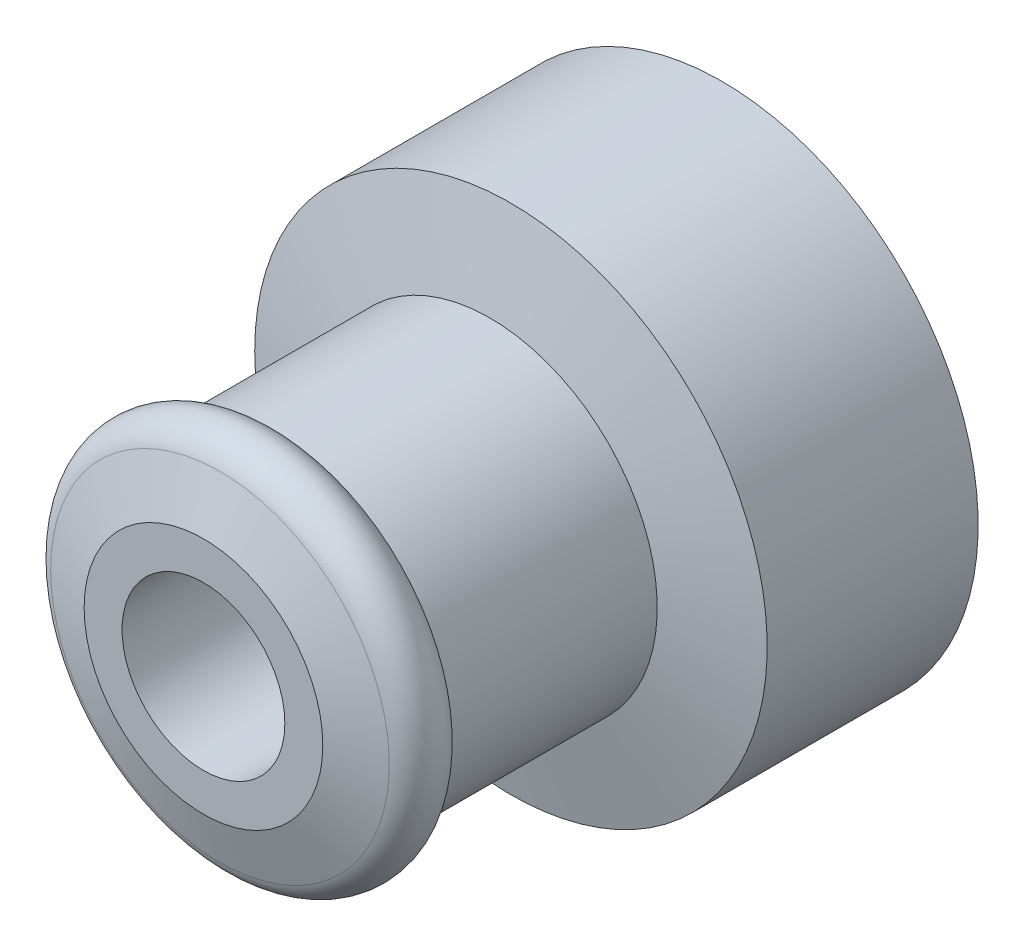
ISO-10303-21;
HEADER;
FILE_DESCRIPTION(('STEP AP214'),'2;1');
FILE_NAME('part.step','',(''),(''),'','','');
FILE_SCHEMA(('AUTOMOTIVE_DESIGN { 1 0 10303 214 1 1 1 1 }'));
ENDSEC;
DATA;
#1=APPLICATION_CONTEXT('core data for automotive mechanical design processes');
#2=APPLICATION_PROTOCOL_DEFINITION('international standard','automotive_design',2000,#1);
#3=PRODUCT_CONTEXT('',#1,'mechanical');
#4=PRODUCT('Part','Part','',(#3));
#5=PRODUCT_RELATED_PRODUCT_CATEGORY('part','',(#4));
#6=PRODUCT_DEFINITION_FORMATION('','',#4);
#7=PRODUCT_DEFINITION_CONTEXT('part definition',#1,'design');
#8=PRODUCT_DEFINITION('design','',#6,#7);
#9=PRODUCT_DEFINITION_SHAPE('','',#8);
#10=(LENGTH_UNIT() NAMED_UNIT(*) SI_UNIT(.MILLI.,.METRE.));
#11=(NAMED_UNIT(*) PLANE_ANGLE_UNIT() SI_UNIT($,.RADIAN.));
#12=(NAMED_UNIT(*) SI_UNIT($,.STERADIAN.) SOLID_ANGLE_UNIT());
#13=UNCERTAINTY_MEASURE_WITH_UNIT(LENGTH_MEASURE(1.E-05),#10,'distance_accuracy_value','');
#14=(GEOMETRIC_REPRESENTATION_CONTEXT(3) GLOBAL_UNCERTAINTY_ASSIGNED_CONTEXT((#13)) GLOBAL_UNIT_ASSIGNED_CONTEXT((#10,
#11,#12)) REPRESENTATION_CONTEXT('',''));
#15=CARTESIAN_POINT('',(0.,0.,0.));
#16=DIRECTION('',(0.,0.,1.));
#17=DIRECTION('',(1.,0.,0.));
#18=AXIS2_PLACEMENT_3D('',#15,#16,#17);
#19=CARTESIAN_POINT('',(7.99999999999999,0.,-8.00000000000004));
#20=DIRECTION('',(0.,0.,-1.));
#21=DIRECTION('',(-1.,0.,0.));
#22=AXIS2_PLACEMENT_3D('',#19,#20,#21);
#23=PLANE('',#22);
#24=CARTESIAN_POINT('',(7.99999999999999,0.,-8.00000000000004));
#25=DIRECTION('',(0.,0.,-1.));
#26=DIRECTION('',(-1.,0.,0.));
#27=AXIS2_PLACEMENT_3D('',#24,#25,#26);
#28=CIRCLE('',#27,8.5);
#29=CARTESIAN_POINT('',(-0.500000000000007,0.,-8.00000000000005));
#30=VERTEX_POINT('',#29);
#31=EDGE_CURVE('E161',#30,#30,#28,.T.);
#32=ORIENTED_EDGE('',*,*,#31,.T.);
#33=EDGE_LOOP('',(#32));
#34=FACE_BOUND('',#33,.T.);
#35=DIRECTION('',(0.,1.,0.));
#36=VECTOR('',#35,1.);
#37=CARTESIAN_POINT('',(5.49999999999999,0.,-8.00000000000004));
#38=LINE('',#37,#36);
#39=CARTESIAN_POINT('',(5.49999999999999,-2.80615724127025,-8.00000000000004));
#40=VERTEX_POINT('',#39);
#41=CARTESIAN_POINT('',(5.49999999999999,-1.61245154965971,-8.00000000000004));
#42=VERTEX_POINT('',#41);
#43=EDGE_CURVE('E153',#40,#42,#38,.T.);
#44=ORIENTED_EDGE('',*,*,#43,.T.);
#45=CARTESIAN_POINT('',(5.64999999999999,-1.61245154965971,-8.00000000000004));
#46=DIRECTION('',(0.,0.,-1.));
#47=DIRECTION('',(-1.,0.,0.));
#48=AXIS2_PLACEMENT_3D('',#45,#46,#47);
#49=CIRCLE('',#48,0.15);
#50=CARTESIAN_POINT('',(5.77368421052631,-1.52758567862498,-8.00000000000004));
#51=VERTEX_POINT('',#50);
#52=EDGE_CURVE('E214',#42,#51,#49,.T.);
#53=ORIENTED_EDGE('',*,*,#52,.T.);
#54=CARTESIAN_POINT('',(7.99999999999999,0.,-8.00000000000004));
#55=DIRECTION('',(0.,0.,1.));
#56=DIRECTION('',(1.,0.,0.));
#57=AXIS2_PLACEMENT_3D('',#54,#55,#56);
#58=CIRCLE('',#57,2.7);
#59=CARTESIAN_POINT('',(5.77368421052631,1.52758567862499,-8.00000000000004));
#60=VERTEX_POINT('',#59);
#61=EDGE_CURVE('E154',#51,#60,#58,.T.);
#62=ORIENTED_EDGE('',*,*,#61,.T.);
#63=CARTESIAN_POINT('',(5.64999999999999,1.61245154965971,-8.00000000000004));
#64=DIRECTION('',(0.,0.,-1.));
#65=DIRECTION('',(-1.,0.,0.));
#66=AXIS2_PLACEMENT_3D('',#63,#64,#65);
#67=CIRCLE('',#66,0.15);
#68=CARTESIAN_POINT('',(5.49999999999999,1.61245154965971,-8.00000000000004));
#69=VERTEX_POINT('',#68);
#70=EDGE_CURVE('E223',#60,#69,#67,.T.);
#71=ORIENTED_EDGE('',*,*,#70,.T.);
#72=CARTESIAN_POINT('',(5.49999999999999,2.80615724127025,-8.00000000000004));
#73=VERTEX_POINT('',#72);
#74=EDGE_CURVE('E151',#69,#73,#38,.T.);
#75=ORIENTED_EDGE('',*,*,#74,.T.);
#76=DIRECTION('',(-1.,0.,0.));
#77=VECTOR('',#76,1.);
#78=CARTESIAN_POINT('',(7.99999999999999,2.80615724127025,-8.00000000000004));
#79=LINE('',#78,#77);
#80=CARTESIAN_POINT('',(2.69999999999999,2.80615724127025,-8.00000000000004));
#81=VERTEX_POINT('',#80);
#82=EDGE_CURVE('E226',#73,#81,#79,.T.);
#83=ORIENTED_EDGE('',*,*,#82,.T.);
#84=DIRECTION('',(0.,1.,0.));
#85=VECTOR('',#84,1.);
#86=CARTESIAN_POINT('',(2.69999999999999,0.,-8.00000000000004));
#87=LINE('',#86,#85);
#88=CARTESIAN_POINT('',(2.69999999999999,-2.80615724127025,-8.00000000000004));
#89=VERTEX_POINT('',#88);
#90=EDGE_CURVE('E149',#89,#81,#87,.T.);
#91=ORIENTED_EDGE('',*,*,#90,.F.);
#92=DIRECTION('',(1.,0.,0.));
#93=VECTOR('',#92,1.);
#94=CARTESIAN_POINT('',(7.99999999999999,-2.80615724127025,-8.00000000000004));
#95=LINE('',#94,#93);
#96=EDGE_CURVE('E113',#89,#40,#95,.T.);
#97=ORIENTED_EDGE('',*,*,#96,.T.);
#98=EDGE_LOOP('',(#44,#53,#62,#71,#75,#83,#91,#97));
#99=FACE_BOUND('',#98,.T.);
#100=ADVANCED_FACE('F34',(#34,#99),#23,.T.);
#101=CARTESIAN_POINT('',(7.99999999999999,0.,-8.00000000000004));
#102=DIRECTION('',(0.,0.,1.));
#103=DIRECTION('',(1.,0.,0.));
#104=AXIS2_PLACEMENT_3D('',#101,#102,#103);
#105=CYLINDRICAL_SURFACE('',#104,2.7);
#106=CARTESIAN_POINT('',(7.99999999999997,0.,9.19999999999997));
#107=DIRECTION('',(0.,0.,1.));
#108=DIRECTION('',(1.,0.,0.));
#109=AXIS2_PLACEMENT_3D('',#106,#107,#108);
#110=CIRCLE('',#109,2.7);
#111=CARTESIAN_POINT('',(10.7,0.,9.19999999999997));
#112=VERTEX_POINT('',#111);
#113=EDGE_CURVE('E157',#112,#112,#110,.T.);
#114=ORIENTED_EDGE('',*,*,#113,.T.);
#115=EDGE_LOOP('',(#114));
#116=FACE_BOUND('',#115,.T.);
#117=ORIENTED_EDGE('',*,*,#61,.F.);
#118=DIRECTION('',(0.,0.,1.));
#119=VECTOR('',#118,1.);
#120=CARTESIAN_POINT('',(5.77368421052631,-1.52758567862499,-8.00000000000004));
#121=LINE('',#120,#119);
#122=CARTESIAN_POINT('',(5.7736842105263,-1.52758567862499,-2.14168072549279));
#123=VERTEX_POINT('',#122);
#124=EDGE_CURVE('E233',#51,#123,#121,.T.);
#125=ORIENTED_EDGE('',*,*,#124,.T.);
#126=CARTESIAN_POINT('',(7.99999999999998,0.,-1.25972872272844));
#127=DIRECTION('',(0.,0.5,-0.866025403784439));
#128=DIRECTION('',(0.,0.866025403784439,0.5));
#129=AXIS2_PLACEMENT_3D('',#126,#127,#128);
#130=ELLIPSE('',#129,3.11769145362398,2.7);
#131=CARTESIAN_POINT('',(5.29999999999998,0.,-1.25972872272844));
#132=VERTEX_POINT('',#131);
#133=EDGE_CURVE('E55',#132,#123,#130,.F.);
#134=ORIENTED_EDGE('',*,*,#133,.F.);
#135=CARTESIAN_POINT('',(7.99999999999998,0.,-1.25972872272844));
#136=DIRECTION('',(0.,-0.5,-0.866025403784439));
#137=DIRECTION('',(0.,-0.866025403784439,0.5));
#138=AXIS2_PLACEMENT_3D('',#135,#136,#137);
#139=ELLIPSE('',#138,3.11769145362398,2.7);
#140=CARTESIAN_POINT('',(5.7736842105263,1.52758567862499,-2.14168072549279));
#141=VERTEX_POINT('',#140);
#142=EDGE_CURVE('E186',#141,#132,#139,.F.);
#143=ORIENTED_EDGE('',*,*,#142,.F.);
#144=DIRECTION('',(0.,0.,1.));
#145=VECTOR('',#144,1.);
#146=CARTESIAN_POINT('',(5.77368421052631,1.52758567862499,-8.00000000000004));
#147=LINE('',#146,#145);
#148=EDGE_CURVE('E231',#141,#60,#147,.F.);
#149=ORIENTED_EDGE('',*,*,#148,.T.);
#150=EDGE_LOOP('',(#117,#125,#134,#143,#149));
#151=FACE_BOUND('',#150,.T.);
#152=ADVANCED_FACE('F200',(#116,#151),#105,.F.);
#153=CARTESIAN_POINT('',(7.99999999999999,0.,-8.00000000000004));
#154=DIRECTION('',(0.,0.,-1.));
#155=DIRECTION('',(-1.,0.,0.));
#156=AXIS2_PLACEMENT_3D('',#153,#154,#155);
#157=CYLINDRICAL_SURFACE('',#156,8.5);
#158=ORIENTED_EDGE('',*,*,#31,.F.);
#159=EDGE_LOOP('',(#158));
#160=FACE_BOUND('',#159,.T.);
#161=CARTESIAN_POINT('',(7.99999999999998,0.,-1.00000000000003));
#162=DIRECTION('',(0.,0.,-1.));
#163=DIRECTION('',(-1.,0.,0.));
#164=AXIS2_PLACEMENT_3D('',#161,#162,#163);
#165=CIRCLE('',#164,8.5);
#166=CARTESIAN_POINT('',(-0.50000000000002,0.,-1.00000000000005));
#167=VERTEX_POINT('',#166);
#168=EDGE_CURVE('E164',#167,#167,#165,.T.);
#169=ORIENTED_EDGE('',*,*,#168,.T.);
#170=EDGE_LOOP('',(#169));
#171=FACE_BOUND('',#170,.T.);
#172=CARTESIAN_POINT('',(-0.500000000000011,0.,-6.20000000000005));
#173=CARTESIAN_POINT('',(-0.499998258874818,-0.0944807415474763,-6.19999652435286));
#174=CARTESIAN_POINT('',(-0.498408548029935,-0.189005422342588,-6.19209696695505));
#175=CARTESIAN_POINT('',(-0.492220215594941,-0.375382963071333,-6.16073254980413));
#176=CARTESIAN_POINT('',(-0.487619203623175,-0.467233639820305,-6.13725532423748));
#177=CARTESIAN_POINT('',(-0.475922037730885,-0.645541518947632,-6.07548983484471));
#178=CARTESIAN_POINT('',(-0.468828274304217,-0.732003795486327,-6.03721575736408));
#179=CARTESIAN_POINT('',(-0.452916766600353,-0.897273581069183,-5.94698517923085));
#180=CARTESIAN_POINT('',(-0.444099125007029,-0.97608154562888,-5.8950294934678));
#181=CARTESIAN_POINT('',(-0.425576810609498,-1.12487891143527,-5.77816455970461));
#182=CARTESIAN_POINT('',(-0.415862673573916,-1.19474971696949,-5.713105795835));
#183=CARTESIAN_POINT('',(-0.396711067694012,-1.32266248623365,-5.57220289213415));
#184=CARTESIAN_POINT('',(-0.387273620507215,-1.38070352610972,-5.49635791073035));
#185=CARTESIAN_POINT('',(-0.36965151081447,-1.48381398069095,-5.33518247187986));
#186=CARTESIAN_POINT('',(-0.361479025204092,-1.52876059607197,-5.24977200554624));
#187=CARTESIAN_POINT('',(-0.347446556993114,-1.60361963318652,-5.07242090769311));
#188=CARTESIAN_POINT('',(-0.341586345953364,-1.6335335401433,-4.98048092231126));
#189=CARTESIAN_POINT('',(-0.332937689287491,-1.67709300980421,-4.79395658135659));
#190=CARTESIAN_POINT('',(-0.330109991822201,-1.69094664652992,-4.69942267495826));
#191=CARTESIAN_POINT('',(-0.327728376030672,-1.7026386171344,-4.50933330368067));
#192=CARTESIAN_POINT('',(-0.328174122953305,-1.70047858861295,-4.4137779442558));
#193=CARTESIAN_POINT('',(-0.332253369519151,-1.68037277427309,-4.22588046036434));
#194=CARTESIAN_POINT('',(-0.335838698598992,-1.66266551841464,-4.13351161043361));
#195=CARTESIAN_POINT('',(-0.345717284720032,-1.61234440385919,-3.95308266967294));
#196=CARTESIAN_POINT('',(-0.352010671082253,-1.57972983327116,-3.86502278483773));
#197=CARTESIAN_POINT('',(-0.366645514506951,-1.50029213224702,-3.69502405510393));
#198=CARTESIAN_POINT('',(-0.375000526832988,-1.45337445709459,-3.61313060473245));
#199=CARTESIAN_POINT('',(-0.392808519142065,-1.34672907677355,-3.45828955504626));
#200=CARTESIAN_POINT('',(-0.402261625252234,-1.28699989940661,-3.38534298535308));
#201=CARTESIAN_POINT('',(-0.421409361104865,-1.15514988875299,-3.24909001582326));
#202=CARTESIAN_POINT('',(-0.431105276585397,-1.08282547406116,-3.18598063463953));
#203=CARTESIAN_POINT('',(-0.449490428144958,-0.928514540905417,-3.07275846128797));
#204=CARTESIAN_POINT('',(-0.458179651312567,-0.846527898544961,-3.02264583580096));
#205=CARTESIAN_POINT('',(-0.473593732735097,-0.675000957694165,-2.93680323431589));
#206=CARTESIAN_POINT('',(-0.480315510420635,-0.58544909329501,-2.90109578080433));
#207=CARTESIAN_POINT('',(-0.491013952793605,-0.40145325996273,-2.84528719413448));
#208=CARTESIAN_POINT('',(-0.494990950009049,-0.307009885123164,-2.82518417047488));
#209=CARTESIAN_POINT('',(-0.499705421736768,-0.117604989566156,-2.80143402854978));
#210=CARTESIAN_POINT('',(-0.500495969092002,-0.0226785581534797,-2.79751728678159));
#211=CARTESIAN_POINT('',(-0.498895882811758,0.166472388127614,-2.80552476020175));
#212=CARTESIAN_POINT('',(-0.496505428004599,0.260696942154448,-2.81744808489946));
#213=CARTESIAN_POINT('',(-0.488845144136315,0.44489962190912,-2.85657323502477));
#214=CARTESIAN_POINT('',(-0.483601398871524,0.534908312177836,-2.88363671644648));
#215=CARTESIAN_POINT('',(-0.47082038503757,0.709110166749434,-2.95212277051492));
#216=CARTESIAN_POINT('',(-0.46328294464187,0.793302894783817,-2.99354641895066));
#217=CARTESIAN_POINT('',(-0.446618496066021,0.95461999526657,-3.09016023410728));
#218=CARTESIAN_POINT('',(-0.437473157429895,1.03164521547872,-3.14551272776625));
#219=CARTESIAN_POINT('',(-0.418650492108013,1.17541063250265,-3.26819562505243));
#220=CARTESIAN_POINT('',(-0.408973108462608,1.2421497251823,-3.33552731287982));
#221=CARTESIAN_POINT('',(-0.389998160468418,1.3644890043161,-3.48148469821496));
#222=CARTESIAN_POINT('',(-0.380708623966184,1.41990409416271,-3.56026676517632));
#223=CARTESIAN_POINT('',(-0.363731260535316,1.51671521408705,-3.7261793143064));
#224=CARTESIAN_POINT('',(-0.356043369526839,1.55811180506893,-3.81330946227509));
#225=CARTESIAN_POINT('',(-0.343204589934523,1.62545813068933,-3.99300601845428));
#226=CARTESIAN_POINT('',(-0.338040572827183,1.65148794964479,-4.08554143005759));
#227=CARTESIAN_POINT('',(-0.33080642546444,1.68760470776623,-4.27378687093459));
#228=CARTESIAN_POINT('',(-0.328735891748907,1.69769372598269,-4.36949648455594));
#229=CARTESIAN_POINT('',(-0.327945543733459,1.7015655484747,-4.55951506972539));
#230=CARTESIAN_POINT('',(-0.329165626218126,1.69564083972052,-4.65381795317596));
#231=CARTESIAN_POINT('',(-0.334684749238446,1.6682989169701,-4.84005380483859));
#232=CARTESIAN_POINT('',(-0.338983765041887,1.64688182741981,-4.93198679208122));
#233=CARTESIAN_POINT('',(-0.350149491725708,1.58929356644822,-5.11068710910897));
#234=CARTESIAN_POINT('',(-0.35700995732013,1.55315826141948,-5.19746641285415));
#235=CARTESIAN_POINT('',(-0.372529154560906,1.46719289582273,-5.3637763252486));
#236=CARTESIAN_POINT('',(-0.381188036981209,1.4173616869173,-5.44330632533278));
#237=CARTESIAN_POINT('',(-0.399512328894842,1.3044200551369,-5.59431647265558));
#238=CARTESIAN_POINT('',(-0.409192339464901,1.24109840829981,-5.66563690095496));
#239=CARTESIAN_POINT('',(-0.42836339182324,1.10340942732234,-5.79673654939964));
#240=CARTESIAN_POINT('',(-0.437854389674148,1.02903955816067,-5.85651311353941));
#241=CARTESIAN_POINT('',(-0.455695150595525,0.870429969450018,-5.96341889470901));
#242=CARTESIAN_POINT('',(-0.464031930727193,0.786095103530718,-6.01040920557609));
#243=CARTESIAN_POINT('',(-0.478497126445007,0.610582813599244,-6.08947640841425));
#244=CARTESIAN_POINT('',(-0.484627531356481,0.519411643467313,-6.12156674220529));
#245=CARTESIAN_POINT('',(-0.49279833412131,0.356696531170424,-6.16370831167606));
#246=CARTESIAN_POINT('',(-0.495483153693688,0.286078828823433,-6.17729342930323));
#247=CARTESIAN_POINT('',(-0.499084620378185,0.143649192857113,-6.19544045100927));
#248=CARTESIAN_POINT('',(-0.500001323843645,0.0718372973726521,-6.20000264266665));
#249=CARTESIAN_POINT('',(-0.500000000000011,0.,-6.20000000000005));
#250=B_SPLINE_CURVE_WITH_KNOTS('',3,(#172,#173,#174,#175,#176,#177,#178,#179,#180,#181,#182,
#183,#184,#185,#186,#187,#188,#189,#190,#191,#192,#193,#194,#195,#196,#197,#198,#199,#200,#201,
#202,#203,#204,#205,#206,#207,#208,#209,#210,#211,#212,#213,#214,#215,#216,#217,#218,#219,#220,
#221,#222,#223,#224,#225,#226,#227,#228,#229,#230,#231,#232,#233,#234,#235,#236,#237,#238,#239,
#240,#241,#242,#243,#244,#245,#246,#247,#248,#249),.UNSPECIFIED.,.T.,.F.,(4,2,2,2,2,2,2,2,2,2,2,
2,2,2,2,2,2,2,2,2,2,2,2,2,2,2,2,2,2,2,2,2,2,2,2,2,2,2,4),(0.,0.283179422124139,
0.566583906175249,0.84971734992558,1.13283393379247,1.41938553919072,1.70595951447052,
1.99514031510069,2.28429253920836,2.56965514676098,2.85498857278083,3.13601935910673,
3.41706356731341,3.70000733346107,3.9829836307444,4.27105029235296,4.55912064817694,
4.84763967251841,5.13612373686661,5.41978250649651,5.70342533018375,5.9845177171623,
6.26563116667238,6.5501861225671,6.83477160188081,7.12369068584684,7.41259820829893,
7.69998647755629,7.98733726161705,8.26947528365092,8.55161103937434,8.83306334130287,
9.11453924889173,9.40079729606543,9.68712112705982,9.97644144348583,10.2655002437978,
10.4808191799282,10.6961312533069),.UNSPECIFIED.);
#251=CARTESIAN_POINT('',(-0.500000000000011,0.,-6.20000000000005));
#252=VERTEX_POINT('',#251);
#253=EDGE_CURVE('E176',#252,#252,#250,.T.);
#254=ORIENTED_EDGE('',*,*,#253,.F.);
#255=EDGE_LOOP('',(#254));
#256=FACE_BOUND('',#255,.T.);
#257=ADVANCED_FACE('F188',(#160,#171,#256),#157,.T.);
#258=CARTESIAN_POINT('',(7.99999999999997,0.,9.19999999999997));
#259=DIRECTION('',(0.,0.,-1.));
#260=DIRECTION('',(-1.,0.,0.));
#261=AXIS2_PLACEMENT_3D('',#258,#259,#260);
#262=CONICAL_SURFACE('',#261,3.95858385140002,1.25216712563789);
#263=CARTESIAN_POINT('',(7.99999999999997,0.,8.65292489598673));
#264=DIRECTION('',(0.,0.,-1.));
#265=DIRECTION('',(-1.,0.,0.));
#266=AXIS2_PLACEMENT_3D('',#263,#264,#265);
#267=CIRCLE('',#266,5.61704677997392);
#268=CARTESIAN_POINT('',(2.38295322002604,0.,8.65292489598672));
#269=VERTEX_POINT('',#268);
#270=EDGE_CURVE('E173',#269,#269,#267,.T.);
#271=ORIENTED_EDGE('',*,*,#270,.F.);
#272=EDGE_LOOP('',(#271));
#273=FACE_BOUND('',#272,.T.);
#274=CARTESIAN_POINT('',(7.99999999999997,0.,9.19999999999997));
#275=DIRECTION('',(0.,0.,-1.));
#276=DIRECTION('',(-1.,0.,0.));
#277=AXIS2_PLACEMENT_3D('',#274,#275,#276);
#278=CIRCLE('',#277,3.95858385140002);
#279=CARTESIAN_POINT('',(4.04141614859994,0.,9.19999999999996));
#280=VERTEX_POINT('',#279);
#281=EDGE_CURVE('E158',#280,#280,#278,.T.);
#282=ORIENTED_EDGE('',*,*,#281,.T.);
#283=EDGE_LOOP('',(#282));
#284=FACE_BOUND('',#283,.T.);
#285=ADVANCED_FACE('F319',(#273,#284),#262,.T.);
#286=CARTESIAN_POINT('',(7.99999999999997,0.,7.68495409136932));
#287=DIRECTION('',(0.,0.,-1.));
#288=DIRECTION('',(-1.,0.,0.));
#289=AXIS2_PLACEMENT_3D('',#286,#287,#288);
#290=TOROIDAL_SURFACE('',#289,5.29774345428957,1.01927527802099);
#291=CARTESIAN_POINT('',(7.99999999999997,0.,6.69738701641643));
#292=DIRECTION('',(0.,0.,-1.));
#293=DIRECTION('',(-1.,0.,0.));
#294=AXIS2_PLACEMENT_3D('',#291,#292,#293);
#295=CIRCLE('',#294,5.55);
#296=CARTESIAN_POINT('',(2.44999999999997,0.,6.69738701641642));
#297=VERTEX_POINT('',#296);
#298=EDGE_CURVE('E170',#297,#297,#295,.T.);
#299=ORIENTED_EDGE('',*,*,#298,.F.);
#300=EDGE_LOOP('',(#299));
#301=FACE_BOUND('',#300,.T.);
#302=ORIENTED_EDGE('',*,*,#270,.T.);
#303=EDGE_LOOP('',(#302));
#304=FACE_BOUND('',#303,.T.);
#305=ADVANCED_FACE('F325',(#301,#304),#290,.T.);
#306=CARTESIAN_POINT('',(7.99999999999999,0.,-8.00000000000004));
#307=DIRECTION('',(0.,0.,-1.));
#308=DIRECTION('',(-1.,0.,0.));
#309=AXIS2_PLACEMENT_3D('',#306,#307,#308);
#310=CYLINDRICAL_SURFACE('',#309,5.55);
#311=ORIENTED_EDGE('',*,*,#298,.T.);
#312=EDGE_LOOP('',(#311));
#313=FACE_BOUND('',#312,.T.);
#314=CARTESIAN_POINT('',(7.99999999999998,0.,-0.302612983583574));
#315=DIRECTION('',(0.,0.,-1.));
#316=DIRECTION('',(-1.,0.,0.));
#317=AXIS2_PLACEMENT_3D('',#314,#315,#316);
#318=CIRCLE('',#317,5.55);
#319=CARTESIAN_POINT('',(2.44999999999998,0.,-0.302612983583583));
#320=VERTEX_POINT('',#319);
#321=EDGE_CURVE('E167',#320,#320,#318,.T.);
#322=ORIENTED_EDGE('',*,*,#321,.F.);
#323=EDGE_LOOP('',(#322));
#324=FACE_BOUND('',#323,.T.);
#325=ADVANCED_FACE('F333',(#313,#324),#310,.T.);
#326=CARTESIAN_POINT('',(7.99999999999998,0.,-1.00000000000003));
#327=DIRECTION('',(0.,0.,-1.));
#328=DIRECTION('',(-1.,0.,0.));
#329=AXIS2_PLACEMENT_3D('',#326,#327,#328);
#330=CONICAL_SURFACE('',#329,8.5,1.33865579686517);
#331=ORIENTED_EDGE('',*,*,#321,.T.);
#332=EDGE_LOOP('',(#331));
#333=FACE_BOUND('',#332,.T.);
#334=ORIENTED_EDGE('',*,*,#168,.F.);
#335=EDGE_LOOP('',(#334));
#336=FACE_BOUND('',#335,.T.);
#337=ADVANCED_FACE('F205',(#333,#336),#330,.T.);
#338=CARTESIAN_POINT('',(7.99999999999997,0.,9.19999999999997));
#339=DIRECTION('',(0.,0.,1.));
#340=DIRECTION('',(1.,0.,0.));
#341=AXIS2_PLACEMENT_3D('',#338,#339,#340);
#342=PLANE('',#341);
#343=ORIENTED_EDGE('',*,*,#113,.F.);
#344=EDGE_LOOP('',(#343));
#345=FACE_BOUND('',#344,.T.);
#346=ORIENTED_EDGE('',*,*,#281,.F.);
#347=EDGE_LOOP('',(#346));
#348=FACE_BOUND('',#347,.T.);
#349=ADVANCED_FACE('F197',(#345,#348),#342,.T.);
#350=CARTESIAN_POINT('',(-0.500000000000013,0.,-4.50000000000005));
#351=DIRECTION('',(1.,0.,0.));
#352=DIRECTION('',(0.,0.,-1.));
#353=AXIS2_PLACEMENT_3D('',#350,#351,#352);
#354=CYLINDRICAL_SURFACE('',#353,1.7);
#355=CARTESIAN_POINT('',(2.69999999999999,0.,-4.50000000000004));
#356=DIRECTION('',(-1.,0.,0.));
#357=DIRECTION('',(0.,0.,1.));
#358=AXIS2_PLACEMENT_3D('',#355,#356,#357);
#359=CIRCLE('',#358,1.7);
#360=CARTESIAN_POINT('',(2.69999999999999,0.,-2.80000000000004));
#361=VERTEX_POINT('',#360);
#362=EDGE_CURVE('E124',#361,#361,#359,.T.);
#363=ORIENTED_EDGE('',*,*,#362,.F.);
#364=EDGE_LOOP('',(#363));
#365=FACE_BOUND('',#364,.T.);
#366=ORIENTED_EDGE('',*,*,#253,.T.);
#367=EDGE_LOOP('',(#366));
#368=FACE_BOUND('',#367,.T.);
#369=ADVANCED_FACE('F192',(#365,#368),#354,.F.);
#370=CARTESIAN_POINT('',(2.69999999999999,-2.91862307725789,-2.94479654204634));
#371=DIRECTION('',(0.,0.5,-0.866025403784439));
#372=DIRECTION('',(0.,-0.866025403784439,-0.5));
#373=AXIS2_PLACEMENT_3D('',#370,#371,#372);
#374=PLANE('',#373);
#375=ORIENTED_EDGE('',*,*,#133,.T.);
#376=CARTESIAN_POINT('',(5.64999999999998,-1.61245154965971,-2.1906780589797));
#377=DIRECTION('',(0.,0.5,-0.866025403784439));
#378=DIRECTION('',(0.,0.866025403784439,0.499999999999999));
#379=AXIS2_PLACEMENT_3D('',#376,#377,#378);
#380=ELLIPSE('',#379,0.173205080756888,0.15);
#381=CARTESIAN_POINT('',(5.49999999999998,-1.61245154965971,-2.1906780589797));
#382=VERTEX_POINT('',#381);
#383=EDGE_CURVE('E42',#123,#382,#380,.F.);
#384=ORIENTED_EDGE('',*,*,#383,.T.);
#385=DIRECTION('',(0.,0.866025403784439,0.5));
#386=VECTOR('',#385,1.);
#387=CARTESIAN_POINT('',(5.49999999999999,-2.91862307725789,-2.94479654204634));
#388=LINE('',#387,#386);
#389=CARTESIAN_POINT('',(5.49999999999999,-2.80615724127026,-2.87986436136424));
#390=VERTEX_POINT('',#389);
#391=EDGE_CURVE('E123',#390,#382,#388,.T.);
#392=ORIENTED_EDGE('',*,*,#391,.F.);
#393=DIRECTION('',(1.,0.,0.));
#394=VECTOR('',#393,1.);
#395=CARTESIAN_POINT('',(2.69999999999999,-2.80615724127026,-2.87986436136424));
#396=LINE('',#395,#394);
#397=CARTESIAN_POINT('',(2.69999999999999,-2.80615724127026,-2.87986436136424));
#398=VERTEX_POINT('',#397);
#399=EDGE_CURVE('E110',#398,#390,#396,.T.);
#400=ORIENTED_EDGE('',*,*,#399,.F.);
#401=DIRECTION('',(0.,0.866025403784439,0.5));
#402=VECTOR('',#401,1.);
#403=CARTESIAN_POINT('',(2.69999999999999,-2.91862307725789,-2.94479654204634));
#404=LINE('',#403,#402);
#405=CARTESIAN_POINT('',(2.69999999999998,0.,-1.25972872272844));
#406=VERTEX_POINT('',#405);
#407=EDGE_CURVE('E117',#398,#406,#404,.T.);
#408=ORIENTED_EDGE('',*,*,#407,.T.);
#409=DIRECTION('',(1.,0.,0.));
#410=VECTOR('',#409,1.);
#411=CARTESIAN_POINT('',(2.69999999999998,0.,-1.25972872272844));
#412=LINE('',#411,#410);
#413=EDGE_CURVE('E125',#406,#132,#412,.T.);
#414=ORIENTED_EDGE('',*,*,#413,.T.);
#415=EDGE_LOOP('',(#375,#384,#392,#400,#408,#414));
#416=FACE_BOUND('',#415,.T.);
#417=ADVANCED_FACE('F120',(#416),#374,.T.);
#418=CARTESIAN_POINT('',(2.69999999999999,2.91862307725789,-2.94479654204634));
#419=DIRECTION('',(0.,-0.5,-0.866025403784439));
#420=DIRECTION('',(0.,-0.866025403784439,0.5));
#421=AXIS2_PLACEMENT_3D('',#418,#419,#420);
#422=PLANE('',#421);
#423=ORIENTED_EDGE('',*,*,#142,.T.);
#424=ORIENTED_EDGE('',*,*,#413,.F.);
#425=DIRECTION('',(0.,0.866025403784439,-0.5));
#426=VECTOR('',#425,1.);
#427=CARTESIAN_POINT('',(2.69999999999999,2.91862307725789,-2.94479654204634));
#428=LINE('',#427,#426);
#429=CARTESIAN_POINT('',(2.69999999999999,2.80615724127026,-2.87986436136424));
#430=VERTEX_POINT('',#429);
#431=EDGE_CURVE('E131',#406,#430,#428,.T.);
#432=ORIENTED_EDGE('',*,*,#431,.T.);
#433=DIRECTION('',(1.,0.,0.));
#434=VECTOR('',#433,1.);
#435=CARTESIAN_POINT('',(2.69999999999999,2.80615724127026,-2.87986436136424));
#436=LINE('',#435,#434);
#437=CARTESIAN_POINT('',(5.49999999999999,2.80615724127026,-2.87986436136424));
#438=VERTEX_POINT('',#437);
#439=EDGE_CURVE('E138',#430,#438,#436,.T.);
#440=ORIENTED_EDGE('',*,*,#439,.T.);
#441=DIRECTION('',(0.,0.866025403784439,-0.5));
#442=VECTOR('',#441,1.);
#443=CARTESIAN_POINT('',(5.49999999999999,2.91862307725789,-2.94479654204634));
#444=LINE('',#443,#442);
#445=CARTESIAN_POINT('',(5.49999999999998,1.61245154965971,-2.1906780589797));
#446=VERTEX_POINT('',#445);
#447=EDGE_CURVE('E142',#446,#438,#444,.T.);
#448=ORIENTED_EDGE('',*,*,#447,.F.);
#449=CARTESIAN_POINT('',(5.64999999999998,1.61245154965971,-2.1906780589797));
#450=DIRECTION('',(0.,-0.5,-0.866025403784439));
#451=DIRECTION('',(0.,-0.866025403784439,0.5));
#452=AXIS2_PLACEMENT_3D('',#449,#450,#451);
#453=ELLIPSE('',#452,0.173205080756888,0.15);
#454=EDGE_CURVE('E11',#446,#141,#453,.F.);
#455=ORIENTED_EDGE('',*,*,#454,.T.);
#456=EDGE_LOOP('',(#423,#424,#432,#440,#448,#455));
#457=FACE_BOUND('',#456,.T.);
#458=ADVANCED_FACE('F245',(#457),#422,.T.);
#459=CARTESIAN_POINT('',(5.49999999999999,0.,-8.00000000000004));
#460=DIRECTION('',(-1.,0.,0.));
#461=DIRECTION('',(0.,0.,1.));
#462=AXIS2_PLACEMENT_3D('',#459,#460,#461);
#463=PLANE('',#462);
#464=ORIENTED_EDGE('',*,*,#391,.T.);
#465=DIRECTION('',(0.,0.,-1.));
#466=VECTOR('',#465,1.);
#467=CARTESIAN_POINT('',(5.49999999999999,-1.61245154965971,-8.00000000000004));
#468=LINE('',#467,#466);
#469=EDGE_CURVE('E220',#382,#42,#468,.T.);
#470=ORIENTED_EDGE('',*,*,#469,.T.);
#471=ORIENTED_EDGE('',*,*,#43,.F.);
#472=DIRECTION('',(0.,0.,1.));
#473=VECTOR('',#472,1.);
#474=CARTESIAN_POINT('',(5.49999999999999,-2.80615724127025,-8.00000000000004));
#475=LINE('',#474,#473);
#476=EDGE_CURVE('E139',#40,#390,#475,.T.);
#477=ORIENTED_EDGE('',*,*,#476,.T.);
#478=EDGE_LOOP('',(#464,#470,#471,#477));
#479=FACE_BOUND('',#478,.T.);
#480=ADVANCED_FACE('F218',(#479),#463,.T.);
#481=CARTESIAN_POINT('',(2.69999999999999,-2.80615724127025,-8.00000000000004));
#482=DIRECTION('',(0.,1.,0.));
#483=DIRECTION('',(-1.,0.,0.));
#484=AXIS2_PLACEMENT_3D('',#481,#482,#483);
#485=PLANE('',#484);
#486=DIRECTION('',(0.,0.,1.));
#487=VECTOR('',#486,1.);
#488=CARTESIAN_POINT('',(2.69999999999999,-2.80615724127025,-8.00000000000004));
#489=LINE('',#488,#487);
#490=EDGE_CURVE('E106',#89,#398,#489,.T.);
#491=ORIENTED_EDGE('',*,*,#490,.T.);
#492=ORIENTED_EDGE('',*,*,#399,.T.);
#493=ORIENTED_EDGE('',*,*,#476,.F.);
#494=ORIENTED_EDGE('',*,*,#96,.F.);
#495=EDGE_LOOP('',(#491,#492,#493,#494));
#496=FACE_BOUND('',#495,.T.);
#497=ADVANCED_FACE('F108',(#496),#485,.T.);
#498=CARTESIAN_POINT('',(2.69999999999999,2.80615724127025,-8.00000000000004));
#499=DIRECTION('',(0.,-1.,0.));
#500=DIRECTION('',(0.,0.,1.));
#501=AXIS2_PLACEMENT_3D('',#498,#499,#500);
#502=PLANE('',#501);
#503=DIRECTION('',(0.,0.,-1.));
#504=VECTOR('',#503,1.);
#505=CARTESIAN_POINT('',(5.49999999999999,2.80615724127025,-8.00000000000004));
#506=LINE('',#505,#504);
#507=EDGE_CURVE('E118',#438,#73,#506,.T.);
#508=ORIENTED_EDGE('',*,*,#507,.F.);
#509=ORIENTED_EDGE('',*,*,#439,.F.);
#510=DIRECTION('',(0.,0.,-1.));
#511=VECTOR('',#510,1.);
#512=CARTESIAN_POINT('',(2.69999999999999,2.80615724127025,-8.00000000000004));
#513=LINE('',#512,#511);
#514=EDGE_CURVE('E133',#430,#81,#513,.T.);
#515=ORIENTED_EDGE('',*,*,#514,.T.);
#516=ORIENTED_EDGE('',*,*,#82,.F.);
#517=EDGE_LOOP('',(#508,#509,#515,#516));
#518=FACE_BOUND('',#517,.T.);
#519=ADVANCED_FACE('F250',(#518),#502,.T.);
#520=CARTESIAN_POINT('',(2.69999999999999,0.,-8.00000000000004));
#521=DIRECTION('',(-1.,0.,0.));
#522=DIRECTION('',(0.,0.,1.));
#523=AXIS2_PLACEMENT_3D('',#520,#521,#522);
#524=PLANE('',#523);
#525=ORIENTED_EDGE('',*,*,#90,.T.);
#526=ORIENTED_EDGE('',*,*,#514,.F.);
#527=ORIENTED_EDGE('',*,*,#431,.F.);
#528=ORIENTED_EDGE('',*,*,#407,.F.);
#529=ORIENTED_EDGE('',*,*,#490,.F.);
#530=EDGE_LOOP('',(#525,#526,#527,#528,#529));
#531=FACE_BOUND('',#530,.T.);
#532=ORIENTED_EDGE('',*,*,#362,.T.);
#533=EDGE_LOOP('',(#532));
#534=FACE_BOUND('',#533,.T.);
#535=ADVANCED_FACE('F128',(#531,#534),#524,.F.);
#536=ORIENTED_EDGE('',*,*,#74,.F.);
#537=DIRECTION('',(0.,0.,-1.));
#538=VECTOR('',#537,1.);
#539=CARTESIAN_POINT('',(5.49999999999998,1.61245154965971,-1.84851278048363));
#540=LINE('',#539,#538);
#541=EDGE_CURVE('E235',#69,#446,#540,.F.);
#542=ORIENTED_EDGE('',*,*,#541,.T.);
#543=ORIENTED_EDGE('',*,*,#447,.T.);
#544=ORIENTED_EDGE('',*,*,#507,.T.);
#545=EDGE_LOOP('',(#536,#542,#543,#544));
#546=FACE_BOUND('',#545,.T.);
#547=ADVANCED_FACE('F243',(#546),#463,.T.);
#548=CARTESIAN_POINT('',(5.64999999999999,-1.61245154965971,-8.00000000000004));
#549=DIRECTION('',(0.,0.,1.));
#550=DIRECTION('',(1.,0.,0.));
#551=AXIS2_PLACEMENT_3D('',#548,#549,#550);
#552=CYLINDRICAL_SURFACE('',#551,0.15);
#553=ORIENTED_EDGE('',*,*,#383,.F.);
#554=ORIENTED_EDGE('',*,*,#124,.F.);
#555=ORIENTED_EDGE('',*,*,#52,.F.);
#556=ORIENTED_EDGE('',*,*,#469,.F.);
#557=EDGE_LOOP('',(#553,#554,#555,#556));
#558=FACE_BOUND('',#557,.T.);
#559=ADVANCED_FACE('F237',(#558),#552,.T.);
#560=CARTESIAN_POINT('',(5.64999999999999,1.61245154965971,-8.00000000000004));
#561=DIRECTION('',(0.,0.,1.));
#562=DIRECTION('',(1.,0.,0.));
#563=AXIS2_PLACEMENT_3D('',#560,#561,#562);
#564=CYLINDRICAL_SURFACE('',#563,0.15);
#565=ORIENTED_EDGE('',*,*,#70,.F.);
#566=ORIENTED_EDGE('',*,*,#148,.F.);
#567=ORIENTED_EDGE('',*,*,#454,.F.);
#568=ORIENTED_EDGE('',*,*,#541,.F.);
#569=EDGE_LOOP('',(#565,#566,#567,#568));
#570=FACE_BOUND('',#569,.T.);
#571=ADVANCED_FACE('F36',(#570),#564,.T.);
#572=CLOSED_SHELL('',(#100,#152,#257,#285,#305,#325,#337,#349,#369,#417,#458,#480,#497,#519,
#535,#547,#559,#571));
#573=MANIFOLD_SOLID_BREP('B2',#572);
#574=ADVANCED_BREP_SHAPE_REPRESENTATION('',(#18,#573),#14);
#575=SHAPE_DEFINITION_REPRESENTATION(#9,#574);
ENDSEC;
END-ISO-10303-21;
